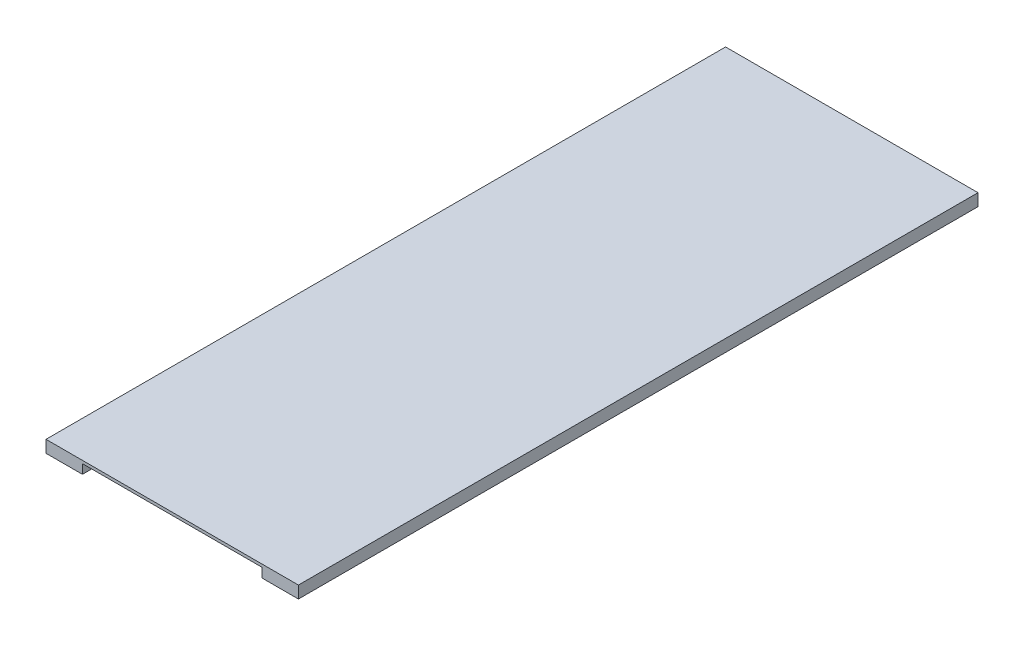
ISO-10303-21;
HEADER;
FILE_DESCRIPTION(('STEP AP214'),'2;1');
FILE_NAME('part.step','',(''),(''),'','','');
FILE_SCHEMA(('AUTOMOTIVE_DESIGN { 1 0 10303 214 1 1 1 1 }'));
ENDSEC;
DATA;
#1=APPLICATION_CONTEXT('core data for automotive mechanical design processes');
#2=APPLICATION_PROTOCOL_DEFINITION('international standard','automotive_design',2000,#1);
#3=PRODUCT_CONTEXT('',#1,'mechanical');
#4=PRODUCT('Part','Part','',(#3));
#5=PRODUCT_RELATED_PRODUCT_CATEGORY('part','',(#4));
#6=PRODUCT_DEFINITION_FORMATION('','',#4);
#7=PRODUCT_DEFINITION_CONTEXT('part definition',#1,'design');
#8=PRODUCT_DEFINITION('design','',#6,#7);
#9=PRODUCT_DEFINITION_SHAPE('','',#8);
#10=(LENGTH_UNIT() NAMED_UNIT(*) SI_UNIT(.MILLI.,.METRE.));
#11=(NAMED_UNIT(*) PLANE_ANGLE_UNIT() SI_UNIT($,.RADIAN.));
#12=(NAMED_UNIT(*) SI_UNIT($,.STERADIAN.) SOLID_ANGLE_UNIT());
#13=UNCERTAINTY_MEASURE_WITH_UNIT(LENGTH_MEASURE(1.E-05),#10,'distance_accuracy_value','');
#14=(GEOMETRIC_REPRESENTATION_CONTEXT(3) GLOBAL_UNCERTAINTY_ASSIGNED_CONTEXT((#13)) GLOBAL_UNIT_ASSIGNED_CONTEXT((#10,
#11,#12)) REPRESENTATION_CONTEXT('',''));
#15=CARTESIAN_POINT('',(0.,0.,0.));
#16=DIRECTION('',(0.,0.,1.));
#17=DIRECTION('',(1.,0.,0.));
#18=AXIS2_PLACEMENT_3D('',#15,#16,#17);
#19=CARTESIAN_POINT('',(-15.,-3.82808264704511,280.));
#20=DIRECTION('',(0.,1.,0.));
#21=DIRECTION('',(0.,0.,1.));
#22=AXIS2_PLACEMENT_3D('',#19,#20,#21);
#23=PLANE('',#22);
#24=DIRECTION('',(1.,0.,0.));
#25=VECTOR('',#24,1.);
#26=CARTESIAN_POINT('',(-15.,-3.82808264704511,0.));
#27=LINE('',#26,#25);
#28=CARTESIAN_POINT('',(-15.,-3.82808264704511,0.));
#29=VERTEX_POINT('',#28);
#30=CARTESIAN_POINT('',(0.,-3.82808264704511,0.));
#31=VERTEX_POINT('',#30);
#32=EDGE_CURVE('E129',#29,#31,#27,.T.);
#33=ORIENTED_EDGE('',*,*,#32,.T.);
#34=DIRECTION('',(0.,0.,-1.));
#35=VECTOR('',#34,1.);
#36=CARTESIAN_POINT('',(0.,-3.82808264704511,280.));
#37=LINE('',#36,#35);
#38=CARTESIAN_POINT('',(0.,-3.82808264704511,280.));
#39=VERTEX_POINT('',#38);
#40=EDGE_CURVE('E11',#39,#31,#37,.T.);
#41=ORIENTED_EDGE('',*,*,#40,.F.);
#42=DIRECTION('',(1.,0.,0.));
#43=VECTOR('',#42,1.);
#44=CARTESIAN_POINT('',(-15.,-3.82808264704511,280.));
#45=LINE('',#44,#43);
#46=CARTESIAN_POINT('',(-15.,-3.82808264704511,280.));
#47=VERTEX_POINT('',#46);
#48=EDGE_CURVE('E143',#47,#39,#45,.T.);
#49=ORIENTED_EDGE('',*,*,#48,.F.);
#50=DIRECTION('',(0.,0.,-1.));
#51=VECTOR('',#50,1.);
#52=CARTESIAN_POINT('',(-15.,-3.82808264704511,280.));
#53=LINE('',#52,#51);
#54=EDGE_CURVE('E125',#47,#29,#53,.T.);
#55=ORIENTED_EDGE('',*,*,#54,.T.);
#56=EDGE_LOOP('',(#33,#41,#49,#55));
#57=FACE_BOUND('',#56,.T.);
#58=ADVANCED_FACE('F33',(#57),#23,.F.);
#59=CARTESIAN_POINT('',(0.,-3.82808264704511,280.));
#60=DIRECTION('',(-1.,0.,0.));
#61=DIRECTION('',(0.,0.,1.));
#62=AXIS2_PLACEMENT_3D('',#59,#60,#61);
#63=PLANE('',#62);
#64=DIRECTION('',(0.,1.,0.));
#65=VECTOR('',#64,1.);
#66=CARTESIAN_POINT('',(0.,-3.82808264704511,0.));
#67=LINE('',#66,#65);
#68=CARTESIAN_POINT('',(0.,0.,0.));
#69=VERTEX_POINT('',#68);
#70=EDGE_CURVE('E132',#31,#69,#67,.T.);
#71=ORIENTED_EDGE('',*,*,#70,.T.);
#72=DIRECTION('',(0.,0.,-1.));
#73=VECTOR('',#72,1.);
#74=CARTESIAN_POINT('',(0.,0.,280.));
#75=LINE('',#74,#73);
#76=CARTESIAN_POINT('',(0.,0.,280.));
#77=VERTEX_POINT('',#76);
#78=EDGE_CURVE('E41',#77,#69,#75,.T.);
#79=ORIENTED_EDGE('',*,*,#78,.F.);
#80=DIRECTION('',(0.,1.,0.));
#81=VECTOR('',#80,1.);
#82=CARTESIAN_POINT('',(0.,-3.82808264704511,280.));
#83=LINE('',#82,#81);
#84=EDGE_CURVE('E92',#39,#77,#83,.T.);
#85=ORIENTED_EDGE('',*,*,#84,.F.);
#86=ORIENTED_EDGE('',*,*,#40,.T.);
#87=EDGE_LOOP('',(#71,#79,#85,#86));
#88=FACE_BOUND('',#87,.T.);
#89=ADVANCED_FACE('F178',(#88),#63,.F.);
#90=CARTESIAN_POINT('',(0.,0.,280.));
#91=DIRECTION('',(0.,1.,0.));
#92=DIRECTION('',(0.,0.,1.));
#93=AXIS2_PLACEMENT_3D('',#90,#91,#92);
#94=PLANE('',#93);
#95=DIRECTION('',(1.,0.,0.));
#96=VECTOR('',#95,1.);
#97=CARTESIAN_POINT('',(0.,0.,0.));
#98=LINE('',#97,#96);
#99=CARTESIAN_POINT('',(74.,0.,0.));
#100=VERTEX_POINT('',#99);
#101=EDGE_CURVE('E134',#69,#100,#98,.T.);
#102=ORIENTED_EDGE('',*,*,#101,.T.);
#103=DIRECTION('',(0.,0.,-1.));
#104=VECTOR('',#103,1.);
#105=CARTESIAN_POINT('',(74.,0.,280.));
#106=LINE('',#105,#104);
#107=CARTESIAN_POINT('',(74.,0.,280.));
#108=VERTEX_POINT('',#107);
#109=EDGE_CURVE('E150',#108,#100,#106,.T.);
#110=ORIENTED_EDGE('',*,*,#109,.F.);
#111=DIRECTION('',(1.,0.,0.));
#112=VECTOR('',#111,1.);
#113=CARTESIAN_POINT('',(0.,0.,280.));
#114=LINE('',#113,#112);
#115=EDGE_CURVE('E158',#77,#108,#114,.T.);
#116=ORIENTED_EDGE('',*,*,#115,.F.);
#117=ORIENTED_EDGE('',*,*,#78,.T.);
#118=EDGE_LOOP('',(#102,#110,#116,#117));
#119=FACE_BOUND('',#118,.T.);
#120=ADVANCED_FACE('F156',(#119),#94,.F.);
#121=CARTESIAN_POINT('',(74.,0.,280.));
#122=DIRECTION('',(1.,0.,0.));
#123=DIRECTION('',(0.,0.,-1.));
#124=AXIS2_PLACEMENT_3D('',#121,#122,#123);
#125=PLANE('',#124);
#126=DIRECTION('',(0.,-1.,0.));
#127=VECTOR('',#126,1.);
#128=CARTESIAN_POINT('',(74.,0.,0.));
#129=LINE('',#128,#127);
#130=CARTESIAN_POINT('',(74.,-3.82808264704511,0.));
#131=VERTEX_POINT('',#130);
#132=EDGE_CURVE('E136',#100,#131,#129,.T.);
#133=ORIENTED_EDGE('',*,*,#132,.T.);
#134=DIRECTION('',(0.,0.,-1.));
#135=VECTOR('',#134,1.);
#136=CARTESIAN_POINT('',(74.,-3.82808264704511,280.));
#137=LINE('',#136,#135);
#138=CARTESIAN_POINT('',(74.,-3.82808264704511,280.));
#139=VERTEX_POINT('',#138);
#140=EDGE_CURVE('E147',#139,#131,#137,.T.);
#141=ORIENTED_EDGE('',*,*,#140,.F.);
#142=DIRECTION('',(0.,-1.,0.));
#143=VECTOR('',#142,1.);
#144=CARTESIAN_POINT('',(74.,0.,280.));
#145=LINE('',#144,#143);
#146=EDGE_CURVE('E170',#108,#139,#145,.T.);
#147=ORIENTED_EDGE('',*,*,#146,.F.);
#148=ORIENTED_EDGE('',*,*,#109,.T.);
#149=EDGE_LOOP('',(#133,#141,#147,#148));
#150=FACE_BOUND('',#149,.T.);
#151=ADVANCED_FACE('F166',(#150),#125,.F.);
#152=CARTESIAN_POINT('',(74.,-3.82808264704511,280.));
#153=DIRECTION('',(0.,1.,0.));
#154=DIRECTION('',(0.,0.,1.));
#155=AXIS2_PLACEMENT_3D('',#152,#153,#154);
#156=PLANE('',#155);
#157=DIRECTION('',(1.,0.,0.));
#158=VECTOR('',#157,1.);
#159=CARTESIAN_POINT('',(74.,-3.82808264704511,0.));
#160=LINE('',#159,#158);
#161=CARTESIAN_POINT('',(89.,-3.82808264704511,0.));
#162=VERTEX_POINT('',#161);
#163=EDGE_CURVE('E138',#131,#162,#160,.T.);
#164=ORIENTED_EDGE('',*,*,#163,.T.);
#165=DIRECTION('',(0.,0.,-1.));
#166=VECTOR('',#165,1.);
#167=CARTESIAN_POINT('',(89.,-3.82808264704511,280.));
#168=LINE('',#167,#166);
#169=CARTESIAN_POINT('',(89.,-3.82808264704511,280.));
#170=VERTEX_POINT('',#169);
#171=EDGE_CURVE('E120',#170,#162,#168,.T.);
#172=ORIENTED_EDGE('',*,*,#171,.F.);
#173=DIRECTION('',(1.,0.,0.));
#174=VECTOR('',#173,1.);
#175=CARTESIAN_POINT('',(74.,-3.82808264704511,280.));
#176=LINE('',#175,#174);
#177=EDGE_CURVE('E111',#139,#170,#176,.T.);
#178=ORIENTED_EDGE('',*,*,#177,.F.);
#179=ORIENTED_EDGE('',*,*,#140,.T.);
#180=EDGE_LOOP('',(#164,#172,#178,#179));
#181=FACE_BOUND('',#180,.T.);
#182=ADVANCED_FACE('F169',(#181),#156,.F.);
#183=CARTESIAN_POINT('',(89.,1.17191735295489,280.));
#184=DIRECTION('',(-1.,0.,0.));
#185=DIRECTION('',(0.,0.,1.));
#186=AXIS2_PLACEMENT_3D('',#183,#184,#185);
#187=PLANE('',#186);
#188=DIRECTION('',(0.,1.,0.));
#189=VECTOR('',#188,1.);
#190=CARTESIAN_POINT('',(89.,1.17191735295489,0.));
#191=LINE('',#190,#189);
#192=CARTESIAN_POINT('',(89.,1.17191735295489,0.));
#193=VERTEX_POINT('',#192);
#194=EDGE_CURVE('E119',#162,#193,#191,.T.);
#195=ORIENTED_EDGE('',*,*,#194,.T.);
#196=DIRECTION('',(0.,0.,-1.));
#197=VECTOR('',#196,1.);
#198=CARTESIAN_POINT('',(89.,1.17191735295489,280.));
#199=LINE('',#198,#197);
#200=CARTESIAN_POINT('',(89.,1.17191735295489,280.));
#201=VERTEX_POINT('',#200);
#202=EDGE_CURVE('E116',#201,#193,#199,.T.);
#203=ORIENTED_EDGE('',*,*,#202,.F.);
#204=DIRECTION('',(0.,1.,0.));
#205=VECTOR('',#204,1.);
#206=CARTESIAN_POINT('',(89.,1.17191735295489,280.));
#207=LINE('',#206,#205);
#208=EDGE_CURVE('E105',#170,#201,#207,.T.);
#209=ORIENTED_EDGE('',*,*,#208,.F.);
#210=ORIENTED_EDGE('',*,*,#171,.T.);
#211=EDGE_LOOP('',(#195,#203,#209,#210));
#212=FACE_BOUND('',#211,.T.);
#213=ADVANCED_FACE('F117',(#212),#187,.F.);
#214=CARTESIAN_POINT('',(-15.,1.17191735295489,280.));
#215=DIRECTION('',(0.,-1.,0.));
#216=DIRECTION('',(1.,0.,0.));
#217=AXIS2_PLACEMENT_3D('',#214,#215,#216);
#218=PLANE('',#217);
#219=DIRECTION('',(-1.,0.,0.));
#220=VECTOR('',#219,1.);
#221=CARTESIAN_POINT('',(-15.,1.17191735295489,0.));
#222=LINE('',#221,#220);
#223=CARTESIAN_POINT('',(-15.,1.17191735295489,0.));
#224=VERTEX_POINT('',#223);
#225=EDGE_CURVE('E78',#193,#224,#222,.T.);
#226=ORIENTED_EDGE('',*,*,#225,.T.);
#227=DIRECTION('',(0.,0.,-1.));
#228=VECTOR('',#227,1.);
#229=CARTESIAN_POINT('',(-15.,1.17191735295489,280.));
#230=LINE('',#229,#228);
#231=CARTESIAN_POINT('',(-15.,1.17191735295489,280.));
#232=VERTEX_POINT('',#231);
#233=EDGE_CURVE('E121',#232,#224,#230,.T.);
#234=ORIENTED_EDGE('',*,*,#233,.F.);
#235=DIRECTION('',(-1.,0.,0.));
#236=VECTOR('',#235,1.);
#237=CARTESIAN_POINT('',(-15.,1.17191735295489,280.));
#238=LINE('',#237,#236);
#239=EDGE_CURVE('E109',#201,#232,#238,.T.);
#240=ORIENTED_EDGE('',*,*,#239,.F.);
#241=ORIENTED_EDGE('',*,*,#202,.T.);
#242=EDGE_LOOP('',(#226,#234,#240,#241));
#243=FACE_BOUND('',#242,.T.);
#244=ADVANCED_FACE('F123',(#243),#218,.F.);
#245=CARTESIAN_POINT('',(-15.,-3.82808264704511,280.));
#246=DIRECTION('',(1.,0.,0.));
#247=DIRECTION('',(0.,0.,-1.));
#248=AXIS2_PLACEMENT_3D('',#245,#246,#247);
#249=PLANE('',#248);
#250=DIRECTION('',(0.,-1.,0.));
#251=VECTOR('',#250,1.);
#252=CARTESIAN_POINT('',(-15.,-3.82808264704511,0.));
#253=LINE('',#252,#251);
#254=EDGE_CURVE('E84',#224,#29,#253,.T.);
#255=ORIENTED_EDGE('',*,*,#254,.T.);
#256=ORIENTED_EDGE('',*,*,#54,.F.);
#257=DIRECTION('',(0.,-1.,0.));
#258=VECTOR('',#257,1.);
#259=CARTESIAN_POINT('',(-15.,-3.82808264704511,280.));
#260=LINE('',#259,#258);
#261=EDGE_CURVE('E49',#232,#47,#260,.T.);
#262=ORIENTED_EDGE('',*,*,#261,.F.);
#263=ORIENTED_EDGE('',*,*,#233,.T.);
#264=EDGE_LOOP('',(#255,#256,#262,#263));
#265=FACE_BOUND('',#264,.T.);
#266=ADVANCED_FACE('F194',(#265),#249,.F.);
#267=CARTESIAN_POINT('',(0.,0.,280.));
#268=DIRECTION('',(0.,0.,1.));
#269=DIRECTION('',(1.,0.,0.));
#270=AXIS2_PLACEMENT_3D('',#267,#268,#269);
#271=PLANE('',#270);
#272=ORIENTED_EDGE('',*,*,#48,.T.);
#273=ORIENTED_EDGE('',*,*,#84,.T.);
#274=ORIENTED_EDGE('',*,*,#115,.T.);
#275=ORIENTED_EDGE('',*,*,#146,.T.);
#276=ORIENTED_EDGE('',*,*,#177,.T.);
#277=ORIENTED_EDGE('',*,*,#208,.T.);
#278=ORIENTED_EDGE('',*,*,#239,.T.);
#279=ORIENTED_EDGE('',*,*,#261,.T.);
#280=EDGE_LOOP('',(#272,#273,#274,#275,#276,#277,#278,#279));
#281=FACE_BOUND('',#280,.T.);
#282=ADVANCED_FACE('F107',(#281),#271,.T.);
#283=CARTESIAN_POINT('',(0.,0.,0.));
#284=DIRECTION('',(0.,0.,1.));
#285=DIRECTION('',(1.,0.,0.));
#286=AXIS2_PLACEMENT_3D('',#283,#284,#285);
#287=PLANE('',#286);
#288=ORIENTED_EDGE('',*,*,#32,.F.);
#289=ORIENTED_EDGE('',*,*,#254,.F.);
#290=ORIENTED_EDGE('',*,*,#225,.F.);
#291=ORIENTED_EDGE('',*,*,#194,.F.);
#292=ORIENTED_EDGE('',*,*,#163,.F.);
#293=ORIENTED_EDGE('',*,*,#132,.F.);
#294=ORIENTED_EDGE('',*,*,#101,.F.);
#295=ORIENTED_EDGE('',*,*,#70,.F.);
#296=EDGE_LOOP('',(#288,#289,#290,#291,#292,#293,#294,#295));
#297=FACE_BOUND('',#296,.T.);
#298=ADVANCED_FACE('F162',(#297),#287,.F.);
#299=CLOSED_SHELL('',(#58,#89,#120,#151,#182,#213,#244,#266,#282,#298));
#300=MANIFOLD_SOLID_BREP('B2',#299);
#301=ADVANCED_BREP_SHAPE_REPRESENTATION('',(#18,#300),#14);
#302=SHAPE_DEFINITION_REPRESENTATION(#9,#301);
ENDSEC;
END-ISO-10303-21;
